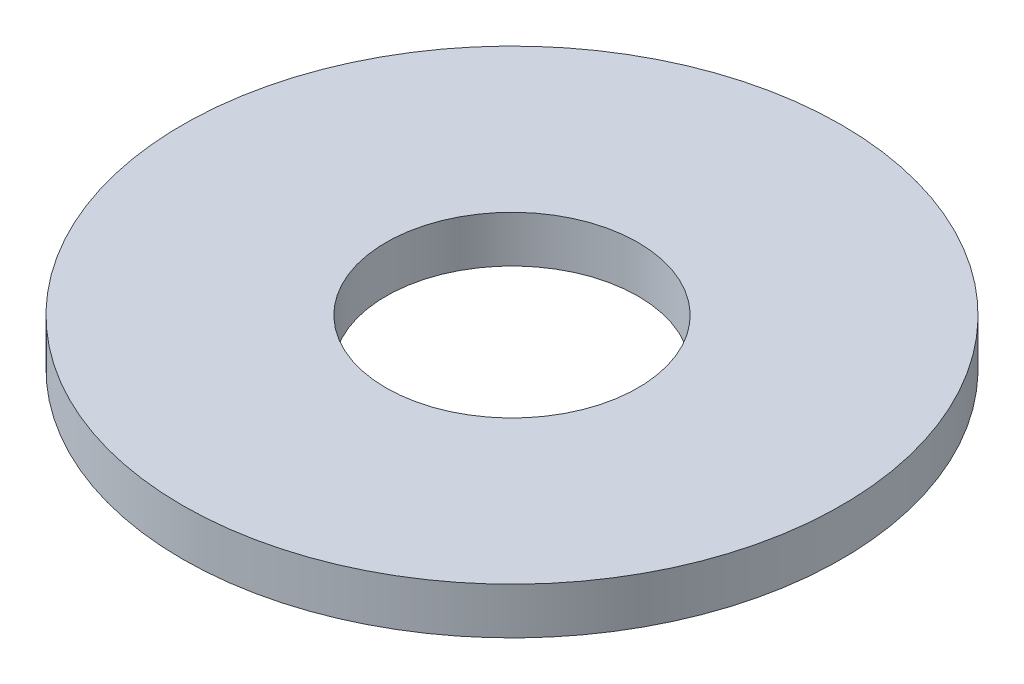
ISO-10303-21;
HEADER;
FILE_DESCRIPTION(('STEP AP214'),'2;1');
FILE_NAME('part.step','',(''),(''),'','','');
FILE_SCHEMA(('AUTOMOTIVE_DESIGN { 1 0 10303 214 1 1 1 1 }'));
ENDSEC;
DATA;
#1=APPLICATION_CONTEXT('core data for automotive mechanical design processes');
#2=APPLICATION_PROTOCOL_DEFINITION('international standard','automotive_design',2000,#1);
#3=PRODUCT_CONTEXT('',#1,'mechanical');
#4=PRODUCT('Part','Part','',(#3));
#5=PRODUCT_RELATED_PRODUCT_CATEGORY('part','',(#4));
#6=PRODUCT_DEFINITION_FORMATION('','',#4);
#7=PRODUCT_DEFINITION_CONTEXT('part definition',#1,'design');
#8=PRODUCT_DEFINITION('design','',#6,#7);
#9=PRODUCT_DEFINITION_SHAPE('','',#8);
#10=(LENGTH_UNIT() NAMED_UNIT(*) SI_UNIT(.MILLI.,.METRE.));
#11=(NAMED_UNIT(*) PLANE_ANGLE_UNIT() SI_UNIT($,.RADIAN.));
#12=(NAMED_UNIT(*) SI_UNIT($,.STERADIAN.) SOLID_ANGLE_UNIT());
#13=UNCERTAINTY_MEASURE_WITH_UNIT(LENGTH_MEASURE(1.E-05),#10,'distance_accuracy_value','');
#14=(GEOMETRIC_REPRESENTATION_CONTEXT(3) GLOBAL_UNCERTAINTY_ASSIGNED_CONTEXT((#13)) GLOBAL_UNIT_ASSIGNED_CONTEXT((#10,
#11,#12)) REPRESENTATION_CONTEXT('',''));
#15=CARTESIAN_POINT('',(0.,0.,0.));
#16=DIRECTION('',(0.,0.,1.));
#17=DIRECTION('',(1.,0.,0.));
#18=AXIS2_PLACEMENT_3D('',#15,#16,#17);
#19=CARTESIAN_POINT('',(0.,12.,0.));
#20=DIRECTION('',(0.,-1.,0.));
#21=DIRECTION('',(0.,0.,-1.));
#22=AXIS2_PLACEMENT_3D('',#19,#20,#21);
#23=CYLINDRICAL_SURFACE('',#22,85.);
#24=CARTESIAN_POINT('',(0.,12.,0.));
#25=DIRECTION('',(0.,1.,0.));
#26=DIRECTION('',(0.,0.,1.));
#27=AXIS2_PLACEMENT_3D('',#24,#25,#26);
#28=CIRCLE('',#27,85.);
#29=CARTESIAN_POINT('',(0.,12.,85.));
#30=VERTEX_POINT('',#29);
#31=EDGE_CURVE('E10',#30,#30,#28,.T.);
#32=ORIENTED_EDGE('',*,*,#31,.F.);
#33=EDGE_LOOP('',(#32));
#34=FACE_BOUND('',#33,.T.);
#35=CARTESIAN_POINT('',(0.,0.,0.));
#36=DIRECTION('',(0.,1.,0.));
#37=DIRECTION('',(0.,0.,1.));
#38=AXIS2_PLACEMENT_3D('',#35,#36,#37);
#39=CIRCLE('',#38,85.);
#40=CARTESIAN_POINT('',(0.,0.,85.));
#41=VERTEX_POINT('',#40);
#42=EDGE_CURVE('E37',#41,#41,#39,.T.);
#43=ORIENTED_EDGE('',*,*,#42,.T.);
#44=EDGE_LOOP('',(#43));
#45=FACE_BOUND('',#44,.T.);
#46=ADVANCED_FACE('F40',(#34,#45),#23,.T.);
#47=CARTESIAN_POINT('',(0.,12.,0.));
#48=DIRECTION('',(0.,1.,0.));
#49=DIRECTION('',(0.,0.,1.));
#50=AXIS2_PLACEMENT_3D('',#47,#48,#49);
#51=PLANE('',#50);
#52=CARTESIAN_POINT('',(0.,12.,0.));
#53=DIRECTION('',(0.,1.,0.));
#54=DIRECTION('',(0.,0.,1.));
#55=AXIS2_PLACEMENT_3D('',#52,#53,#54);
#56=CIRCLE('',#55,32.5);
#57=CARTESIAN_POINT('',(0.,12.,32.5));
#58=VERTEX_POINT('',#57);
#59=EDGE_CURVE('E50',#58,#58,#56,.T.);
#60=ORIENTED_EDGE('',*,*,#59,.F.);
#61=EDGE_LOOP('',(#60));
#62=FACE_BOUND('',#61,.T.);
#63=ORIENTED_EDGE('',*,*,#31,.T.);
#64=EDGE_LOOP('',(#63));
#65=FACE_BOUND('',#64,.T.);
#66=ADVANCED_FACE('F59',(#62,#65),#51,.T.);
#67=CARTESIAN_POINT('',(0.,0.,0.));
#68=DIRECTION('',(0.,1.,0.));
#69=DIRECTION('',(0.,0.,1.));
#70=AXIS2_PLACEMENT_3D('',#67,#68,#69);
#71=PLANE('',#70);
#72=CARTESIAN_POINT('',(0.,0.,0.));
#73=DIRECTION('',(0.,1.,0.));
#74=DIRECTION('',(0.,0.,1.));
#75=AXIS2_PLACEMENT_3D('',#72,#73,#74);
#76=CIRCLE('',#75,32.5);
#77=CARTESIAN_POINT('',(0.,0.,32.5));
#78=VERTEX_POINT('',#77);
#79=EDGE_CURVE('E47',#78,#78,#76,.T.);
#80=ORIENTED_EDGE('',*,*,#79,.T.);
#81=EDGE_LOOP('',(#80));
#82=FACE_BOUND('',#81,.T.);
#83=ORIENTED_EDGE('',*,*,#42,.F.);
#84=EDGE_LOOP('',(#83));
#85=FACE_BOUND('',#84,.T.);
#86=ADVANCED_FACE('F58',(#82,#85),#71,.F.);
#87=CARTESIAN_POINT('',(0.,12.,0.));
#88=DIRECTION('',(0.,-1.,0.));
#89=DIRECTION('',(0.,0.,-1.));
#90=AXIS2_PLACEMENT_3D('',#87,#88,#89);
#91=CYLINDRICAL_SURFACE('',#90,32.5);
#92=ORIENTED_EDGE('',*,*,#59,.T.);
#93=EDGE_LOOP('',(#92));
#94=FACE_BOUND('',#93,.T.);
#95=ORIENTED_EDGE('',*,*,#79,.F.);
#96=EDGE_LOOP('',(#95));
#97=FACE_BOUND('',#96,.T.);
#98=ADVANCED_FACE('F54',(#94,#97),#91,.F.);
#99=CLOSED_SHELL('',(#46,#66,#86,#98));
#100=MANIFOLD_SOLID_BREP('B2',#99);
#101=ADVANCED_BREP_SHAPE_REPRESENTATION('',(#18,#100),#14);
#102=SHAPE_DEFINITION_REPRESENTATION(#9,#101);
ENDSEC;
END-ISO-10303-21;
